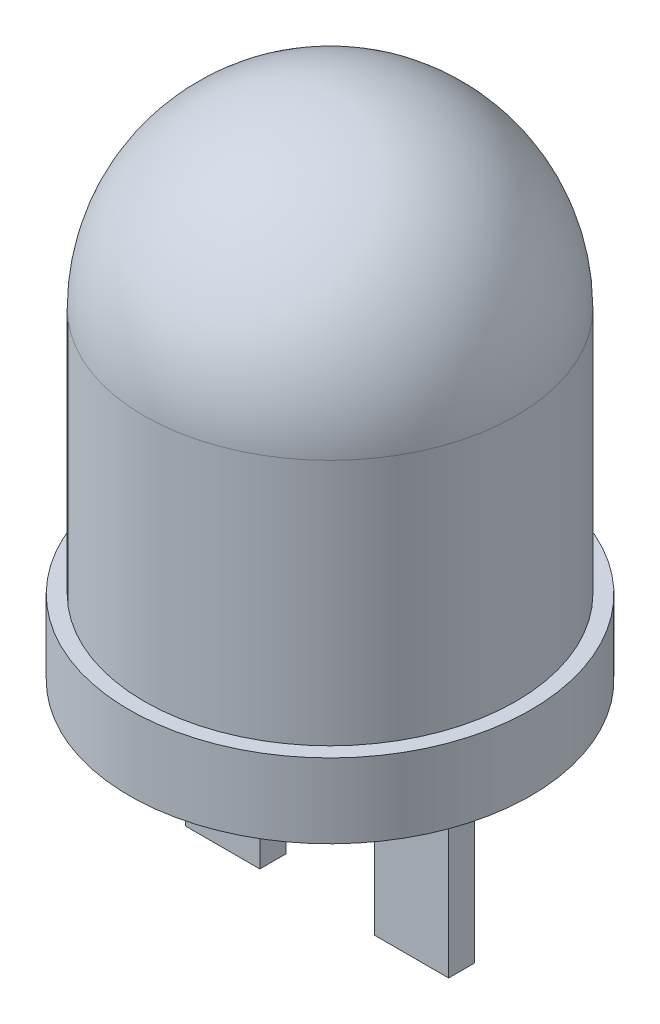
ISO-10303-21;
HEADER;
FILE_DESCRIPTION(('STEP AP214'),'2;1');
FILE_NAME('part.step','',(''),(''),'','','');
FILE_SCHEMA(('AUTOMOTIVE_DESIGN { 1 0 10303 214 1 1 1 1 }'));
ENDSEC;
DATA;
#1=APPLICATION_CONTEXT('core data for automotive mechanical design processes');
#2=APPLICATION_PROTOCOL_DEFINITION('international standard','automotive_design',2000,#1);
#3=PRODUCT_CONTEXT('',#1,'mechanical');
#4=PRODUCT('Part','Part','',(#3));
#5=PRODUCT_RELATED_PRODUCT_CATEGORY('part','',(#4));
#6=PRODUCT_DEFINITION_FORMATION('','',#4);
#7=PRODUCT_DEFINITION_CONTEXT('part definition',#1,'design');
#8=PRODUCT_DEFINITION('design','',#6,#7);
#9=PRODUCT_DEFINITION_SHAPE('','',#8);
#10=(LENGTH_UNIT() NAMED_UNIT(*) SI_UNIT(.MILLI.,.METRE.));
#11=(NAMED_UNIT(*) PLANE_ANGLE_UNIT() SI_UNIT($,.RADIAN.));
#12=(NAMED_UNIT(*) SI_UNIT($,.STERADIAN.) SOLID_ANGLE_UNIT());
#13=UNCERTAINTY_MEASURE_WITH_UNIT(LENGTH_MEASURE(1.E-05),#10,'distance_accuracy_value','');
#14=(GEOMETRIC_REPRESENTATION_CONTEXT(3) GLOBAL_UNCERTAINTY_ASSIGNED_CONTEXT((#13)) GLOBAL_UNIT_ASSIGNED_CONTEXT((#10,
#11,#12)) REPRESENTATION_CONTEXT('',''));
#15=CARTESIAN_POINT('',(0.,0.,0.));
#16=DIRECTION('',(0.,0.,1.));
#17=DIRECTION('',(1.,0.,0.));
#18=AXIS2_PLACEMENT_3D('',#15,#16,#17);
#19=CARTESIAN_POINT('',(0.,0.,0.));
#20=DIRECTION('',(0.,-1.,0.));
#21=DIRECTION('',(0.,0.,-1.));
#22=AXIS2_PLACEMENT_3D('',#19,#20,#21);
#23=PLANE('',#22);
#24=DIRECTION('',(0.,0.,1.));
#25=VECTOR('',#24,1.);
#26=CARTESIAN_POINT('',(-1.54,0.,0.));
#27=LINE('',#26,#25);
#28=CARTESIAN_POINT('',(-1.54,0.,-0.35));
#29=VERTEX_POINT('',#28);
#30=CARTESIAN_POINT('',(-1.54,0.,0.35));
#31=VERTEX_POINT('',#30);
#32=EDGE_CURVE('E11',#29,#31,#27,.T.);
#33=ORIENTED_EDGE('',*,*,#32,.F.);
#34=DIRECTION('',(1.,0.,0.));
#35=VECTOR('',#34,1.);
#36=CARTESIAN_POINT('',(0.,0.,-0.349999999999999));
#37=LINE('',#36,#35);
#38=CARTESIAN_POINT('',(-3.54,0.,-0.35));
#39=VERTEX_POINT('',#38);
#40=EDGE_CURVE('E39',#39,#29,#37,.T.);
#41=ORIENTED_EDGE('',*,*,#40,.F.);
#42=DIRECTION('',(0.,0.,-1.));
#43=VECTOR('',#42,1.);
#44=CARTESIAN_POINT('',(-3.54,0.,0.));
#45=LINE('',#44,#43);
#46=CARTESIAN_POINT('',(-3.54,0.,0.35));
#47=VERTEX_POINT('',#46);
#48=EDGE_CURVE('E169',#47,#39,#45,.T.);
#49=ORIENTED_EDGE('',*,*,#48,.F.);
#50=DIRECTION('',(-1.,0.,0.));
#51=VECTOR('',#50,1.);
#52=CARTESIAN_POINT('',(0.,0.,0.35));
#53=LINE('',#52,#51);
#54=EDGE_CURVE('E167',#31,#47,#53,.T.);
#55=ORIENTED_EDGE('',*,*,#54,.F.);
#56=EDGE_LOOP('',(#33,#41,#49,#55));
#57=FACE_BOUND('',#56,.T.);
#58=DIRECTION('',(0.,0.,-1.));
#59=VECTOR('',#58,1.);
#60=CARTESIAN_POINT('',(1.54,0.,0.));
#61=LINE('',#60,#59);
#62=CARTESIAN_POINT('',(1.54,0.,0.35));
#63=VERTEX_POINT('',#62);
#64=CARTESIAN_POINT('',(1.54,0.,-0.35));
#65=VERTEX_POINT('',#64);
#66=EDGE_CURVE('E164',#63,#65,#61,.T.);
#67=ORIENTED_EDGE('',*,*,#66,.F.);
#68=DIRECTION('',(-1.,0.,0.));
#69=VECTOR('',#68,1.);
#70=CARTESIAN_POINT('',(0.,0.,0.35));
#71=LINE('',#70,#69);
#72=CARTESIAN_POINT('',(3.54,0.,0.35));
#73=VERTEX_POINT('',#72);
#74=EDGE_CURVE('E161',#73,#63,#71,.T.);
#75=ORIENTED_EDGE('',*,*,#74,.F.);
#76=DIRECTION('',(0.,0.,1.));
#77=VECTOR('',#76,1.);
#78=CARTESIAN_POINT('',(3.54,0.,0.));
#79=LINE('',#78,#77);
#80=CARTESIAN_POINT('',(3.54,0.,-0.35));
#81=VERTEX_POINT('',#80);
#82=EDGE_CURVE('E158',#81,#73,#79,.T.);
#83=ORIENTED_EDGE('',*,*,#82,.F.);
#84=DIRECTION('',(1.,0.,0.));
#85=VECTOR('',#84,1.);
#86=CARTESIAN_POINT('',(0.,0.,-0.35));
#87=LINE('',#86,#85);
#88=EDGE_CURVE('E155',#65,#81,#87,.T.);
#89=ORIENTED_EDGE('',*,*,#88,.F.);
#90=EDGE_LOOP('',(#67,#75,#83,#89));
#91=FACE_BOUND('',#90,.T.);
#92=CARTESIAN_POINT('',(0.,0.,0.));
#93=DIRECTION('',(0.,-1.,0.));
#94=DIRECTION('',(0.,0.,-1.));
#95=AXIS2_PLACEMENT_3D('',#92,#93,#94);
#96=CIRCLE('',#95,5.4);
#97=CARTESIAN_POINT('',(0.,0.,-5.4));
#98=VERTEX_POINT('',#97);
#99=EDGE_CURVE('E152',#98,#98,#96,.T.);
#100=ORIENTED_EDGE('',*,*,#99,.T.);
#101=EDGE_LOOP('',(#100));
#102=FACE_BOUND('',#101,.T.);
#103=ADVANCED_FACE('F32',(#57,#91,#102),#23,.T.);
#104=CARTESIAN_POINT('',(0.,0.,0.));
#105=DIRECTION('',(0.,-1.,0.));
#106=DIRECTION('',(0.,0.,-1.));
#107=AXIS2_PLACEMENT_3D('',#104,#105,#106);
#108=CYLINDRICAL_SURFACE('',#107,5.4);
#109=CARTESIAN_POINT('',(0.,2.,0.));
#110=DIRECTION('',(0.,-1.,0.));
#111=DIRECTION('',(0.,0.,-1.));
#112=AXIS2_PLACEMENT_3D('',#109,#110,#111);
#113=CIRCLE('',#112,5.4);
#114=CARTESIAN_POINT('',(0.,2.,-5.4));
#115=VERTEX_POINT('',#114);
#116=EDGE_CURVE('E149',#115,#115,#113,.T.);
#117=ORIENTED_EDGE('',*,*,#116,.T.);
#118=EDGE_LOOP('',(#117));
#119=FACE_BOUND('',#118,.T.);
#120=ORIENTED_EDGE('',*,*,#99,.F.);
#121=EDGE_LOOP('',(#120));
#122=FACE_BOUND('',#121,.T.);
#123=ADVANCED_FACE('F177',(#119,#122),#108,.T.);
#124=CARTESIAN_POINT('',(5.4,2.,0.));
#125=DIRECTION('',(0.,1.,0.));
#126=DIRECTION('',(0.,0.,1.));
#127=AXIS2_PLACEMENT_3D('',#124,#125,#126);
#128=PLANE('',#127);
#129=CARTESIAN_POINT('',(0.,2.,0.));
#130=DIRECTION('',(0.,-1.,0.));
#131=DIRECTION('',(0.,0.,-1.));
#132=AXIS2_PLACEMENT_3D('',#129,#130,#131);
#133=CIRCLE('',#132,5.);
#134=CARTESIAN_POINT('',(0.,2.,-5.));
#135=VERTEX_POINT('',#134);
#136=EDGE_CURVE('E146',#135,#135,#133,.T.);
#137=ORIENTED_EDGE('',*,*,#136,.T.);
#138=EDGE_LOOP('',(#137));
#139=FACE_BOUND('',#138,.T.);
#140=ORIENTED_EDGE('',*,*,#116,.F.);
#141=EDGE_LOOP('',(#140));
#142=FACE_BOUND('',#141,.T.);
#143=ADVANCED_FACE('F182',(#139,#142),#128,.T.);
#144=CARTESIAN_POINT('',(0.,0.,0.));
#145=DIRECTION('',(0.,-1.,0.));
#146=DIRECTION('',(0.,0.,-1.));
#147=AXIS2_PLACEMENT_3D('',#144,#145,#146);
#148=CYLINDRICAL_SURFACE('',#147,5.);
#149=CARTESIAN_POINT('',(0.,8.65,0.));
#150=DIRECTION('',(0.,-1.,0.));
#151=DIRECTION('',(0.,0.,-1.));
#152=AXIS2_PLACEMENT_3D('',#149,#150,#151);
#153=CIRCLE('',#152,5.);
#154=CARTESIAN_POINT('',(0.,8.65,-5.));
#155=VERTEX_POINT('',#154);
#156=EDGE_CURVE('E138',#155,#155,#153,.T.);
#157=ORIENTED_EDGE('',*,*,#156,.T.);
#158=EDGE_LOOP('',(#157));
#159=FACE_BOUND('',#158,.T.);
#160=ORIENTED_EDGE('',*,*,#136,.F.);
#161=EDGE_LOOP('',(#160));
#162=FACE_BOUND('',#161,.T.);
#163=ADVANCED_FACE('F187',(#159,#162),#148,.T.);
#164=CARTESIAN_POINT('',(0.,8.65,0.));
#165=DIRECTION('',(0.,-1.,0.));
#166=DIRECTION('',(1.,0.,0.));
#167=AXIS2_PLACEMENT_3D('',#164,#165,#166);
#168=SPHERICAL_SURFACE('',#167,5.);
#169=ORIENTED_EDGE('',*,*,#156,.F.);
#170=EDGE_LOOP('',(#169));
#171=FACE_BOUND('',#170,.T.);
#172=ADVANCED_FACE('F193',(#171),#168,.T.);
#173=CARTESIAN_POINT('',(1.54,5.,0.35));
#174=DIRECTION('',(-1.,0.,0.));
#175=DIRECTION('',(0.,0.,1.));
#176=AXIS2_PLACEMENT_3D('',#173,#174,#175);
#177=PLANE('',#176);
#178=DIRECTION('',(0.,-1.,0.));
#179=VECTOR('',#178,1.);
#180=CARTESIAN_POINT('',(1.54,5.,0.35));
#181=LINE('',#180,#179);
#182=CARTESIAN_POINT('',(1.54,-5.,0.35));
#183=VERTEX_POINT('',#182);
#184=EDGE_CURVE('E136',#63,#183,#181,.T.);
#185=ORIENTED_EDGE('',*,*,#184,.F.);
#186=ORIENTED_EDGE('',*,*,#66,.T.);
#187=DIRECTION('',(0.,-1.,0.));
#188=VECTOR('',#187,1.);
#189=CARTESIAN_POINT('',(1.54,5.,-0.35));
#190=LINE('',#189,#188);
#191=CARTESIAN_POINT('',(1.54,-5.,-0.35));
#192=VERTEX_POINT('',#191);
#193=EDGE_CURVE('E135',#65,#192,#190,.T.);
#194=ORIENTED_EDGE('',*,*,#193,.T.);
#195=DIRECTION('',(0.,0.,-1.));
#196=VECTOR('',#195,1.);
#197=CARTESIAN_POINT('',(1.54,-5.,0.35));
#198=LINE('',#197,#196);
#199=EDGE_CURVE('E120',#183,#192,#198,.T.);
#200=ORIENTED_EDGE('',*,*,#199,.F.);
#201=EDGE_LOOP('',(#185,#186,#194,#200));
#202=FACE_BOUND('',#201,.T.);
#203=ADVANCED_FACE('F197',(#202),#177,.T.);
#204=CARTESIAN_POINT('',(1.54,5.,0.35));
#205=DIRECTION('',(0.,0.,1.));
#206=DIRECTION('',(1.,0.,0.));
#207=AXIS2_PLACEMENT_3D('',#204,#205,#206);
#208=PLANE('',#207);
#209=DIRECTION('',(0.,-1.,0.));
#210=VECTOR('',#209,1.);
#211=CARTESIAN_POINT('',(3.54,5.,0.35));
#212=LINE('',#211,#210);
#213=CARTESIAN_POINT('',(3.54,-5.,0.35));
#214=VERTEX_POINT('',#213);
#215=EDGE_CURVE('E139',#73,#214,#212,.T.);
#216=ORIENTED_EDGE('',*,*,#215,.F.);
#217=ORIENTED_EDGE('',*,*,#74,.T.);
#218=ORIENTED_EDGE('',*,*,#184,.T.);
#219=DIRECTION('',(-1.,0.,0.));
#220=VECTOR('',#219,1.);
#221=CARTESIAN_POINT('',(1.54,-5.,0.35));
#222=LINE('',#221,#220);
#223=EDGE_CURVE('E132',#214,#183,#222,.T.);
#224=ORIENTED_EDGE('',*,*,#223,.F.);
#225=EDGE_LOOP('',(#216,#217,#218,#224));
#226=FACE_BOUND('',#225,.T.);
#227=ADVANCED_FACE('F201',(#226),#208,.T.);
#228=CARTESIAN_POINT('',(3.54,5.,0.35));
#229=DIRECTION('',(1.,0.,0.));
#230=DIRECTION('',(0.,0.,-1.));
#231=AXIS2_PLACEMENT_3D('',#228,#229,#230);
#232=PLANE('',#231);
#233=DIRECTION('',(0.,-1.,0.));
#234=VECTOR('',#233,1.);
#235=CARTESIAN_POINT('',(3.54,5.,-0.35));
#236=LINE('',#235,#234);
#237=CARTESIAN_POINT('',(3.54,-5.,-0.35));
#238=VERTEX_POINT('',#237);
#239=EDGE_CURVE('E141',#81,#238,#236,.T.);
#240=ORIENTED_EDGE('',*,*,#239,.F.);
#241=ORIENTED_EDGE('',*,*,#82,.T.);
#242=ORIENTED_EDGE('',*,*,#215,.T.);
#243=DIRECTION('',(0.,0.,1.));
#244=VECTOR('',#243,1.);
#245=CARTESIAN_POINT('',(3.54,-5.,0.35));
#246=LINE('',#245,#244);
#247=EDGE_CURVE('E129',#238,#214,#246,.T.);
#248=ORIENTED_EDGE('',*,*,#247,.F.);
#249=EDGE_LOOP('',(#240,#241,#242,#248));
#250=FACE_BOUND('',#249,.T.);
#251=ADVANCED_FACE('F207',(#250),#232,.T.);
#252=CARTESIAN_POINT('',(1.54,5.,-0.35));
#253=DIRECTION('',(0.,0.,-1.));
#254=DIRECTION('',(-1.,0.,0.));
#255=AXIS2_PLACEMENT_3D('',#252,#253,#254);
#256=PLANE('',#255);
#257=ORIENTED_EDGE('',*,*,#193,.F.);
#258=ORIENTED_EDGE('',*,*,#88,.T.);
#259=ORIENTED_EDGE('',*,*,#239,.T.);
#260=DIRECTION('',(1.,0.,0.));
#261=VECTOR('',#260,1.);
#262=CARTESIAN_POINT('',(1.54,-5.,-0.35));
#263=LINE('',#262,#261);
#264=EDGE_CURVE('E126',#192,#238,#263,.T.);
#265=ORIENTED_EDGE('',*,*,#264,.F.);
#266=EDGE_LOOP('',(#257,#258,#259,#265));
#267=FACE_BOUND('',#266,.T.);
#268=ADVANCED_FACE('F203',(#267),#256,.T.);
#269=CARTESIAN_POINT('',(0.,-5.,0.));
#270=DIRECTION('',(0.,-1.,0.));
#271=DIRECTION('',(0.,0.,-1.));
#272=AXIS2_PLACEMENT_3D('',#269,#270,#271);
#273=PLANE('',#272);
#274=ORIENTED_EDGE('',*,*,#199,.T.);
#275=ORIENTED_EDGE('',*,*,#264,.T.);
#276=ORIENTED_EDGE('',*,*,#247,.T.);
#277=ORIENTED_EDGE('',*,*,#223,.T.);
#278=EDGE_LOOP('',(#274,#275,#276,#277));
#279=FACE_BOUND('',#278,.T.);
#280=ADVANCED_FACE('F206',(#279),#273,.T.);
#281=CARTESIAN_POINT('',(-1.54,5.,0.35));
#282=DIRECTION('',(1.,0.,0.));
#283=DIRECTION('',(0.,0.,-1.));
#284=AXIS2_PLACEMENT_3D('',#281,#282,#283);
#285=PLANE('',#284);
#286=DIRECTION('',(0.,-1.,0.));
#287=VECTOR('',#286,1.);
#288=CARTESIAN_POINT('',(-1.54,5.,-0.35));
#289=LINE('',#288,#287);
#290=CARTESIAN_POINT('',(-1.54,-5.,-0.35));
#291=VERTEX_POINT('',#290);
#292=EDGE_CURVE('E118',#29,#291,#289,.T.);
#293=ORIENTED_EDGE('',*,*,#292,.F.);
#294=ORIENTED_EDGE('',*,*,#32,.T.);
#295=DIRECTION('',(0.,-1.,0.));
#296=VECTOR('',#295,1.);
#297=CARTESIAN_POINT('',(-1.54,5.,0.35));
#298=LINE('',#297,#296);
#299=CARTESIAN_POINT('',(-1.54,-5.,0.35));
#300=VERTEX_POINT('',#299);
#301=EDGE_CURVE('E91',#31,#300,#298,.T.);
#302=ORIENTED_EDGE('',*,*,#301,.T.);
#303=DIRECTION('',(0.,0.,1.));
#304=VECTOR('',#303,1.);
#305=CARTESIAN_POINT('',(-1.54,-5.,0.35));
#306=LINE('',#305,#304);
#307=EDGE_CURVE('E96',#291,#300,#306,.T.);
#308=ORIENTED_EDGE('',*,*,#307,.F.);
#309=EDGE_LOOP('',(#293,#294,#302,#308));
#310=FACE_BOUND('',#309,.T.);
#311=ADVANCED_FACE('F94',(#310),#285,.T.);
#312=CARTESIAN_POINT('',(-1.54,5.,-0.35));
#313=DIRECTION('',(0.,0.,-1.));
#314=DIRECTION('',(-1.,0.,0.));
#315=AXIS2_PLACEMENT_3D('',#312,#313,#314);
#316=PLANE('',#315);
#317=DIRECTION('',(0.,-1.,0.));
#318=VECTOR('',#317,1.);
#319=CARTESIAN_POINT('',(-3.54,5.,-0.35));
#320=LINE('',#319,#318);
#321=CARTESIAN_POINT('',(-3.54,-5.,-0.35));
#322=VERTEX_POINT('',#321);
#323=EDGE_CURVE('E121',#39,#322,#320,.T.);
#324=ORIENTED_EDGE('',*,*,#323,.F.);
#325=ORIENTED_EDGE('',*,*,#40,.T.);
#326=ORIENTED_EDGE('',*,*,#292,.T.);
#327=DIRECTION('',(1.,0.,0.));
#328=VECTOR('',#327,1.);
#329=CARTESIAN_POINT('',(-1.54,-5.,-0.35));
#330=LINE('',#329,#328);
#331=EDGE_CURVE('E100',#322,#291,#330,.T.);
#332=ORIENTED_EDGE('',*,*,#331,.F.);
#333=EDGE_LOOP('',(#324,#325,#326,#332));
#334=FACE_BOUND('',#333,.T.);
#335=ADVANCED_FACE('F172',(#334),#316,.T.);
#336=CARTESIAN_POINT('',(-3.54,5.,0.35));
#337=DIRECTION('',(-1.,0.,0.));
#338=DIRECTION('',(0.,0.,1.));
#339=AXIS2_PLACEMENT_3D('',#336,#337,#338);
#340=PLANE('',#339);
#341=DIRECTION('',(0.,-1.,0.));
#342=VECTOR('',#341,1.);
#343=CARTESIAN_POINT('',(-3.54,5.,0.35));
#344=LINE('',#343,#342);
#345=CARTESIAN_POINT('',(-3.54,-5.,0.35));
#346=VERTEX_POINT('',#345);
#347=EDGE_CURVE('E99',#47,#346,#344,.T.);
#348=ORIENTED_EDGE('',*,*,#347,.F.);
#349=ORIENTED_EDGE('',*,*,#48,.T.);
#350=ORIENTED_EDGE('',*,*,#323,.T.);
#351=DIRECTION('',(0.,0.,-1.));
#352=VECTOR('',#351,1.);
#353=CARTESIAN_POINT('',(-3.54,-5.,0.35));
#354=LINE('',#353,#352);
#355=EDGE_CURVE('E109',#346,#322,#354,.T.);
#356=ORIENTED_EDGE('',*,*,#355,.F.);
#357=EDGE_LOOP('',(#348,#349,#350,#356));
#358=FACE_BOUND('',#357,.T.);
#359=ADVANCED_FACE('F174',(#358),#340,.T.);
#360=CARTESIAN_POINT('',(-1.54,5.,0.35));
#361=DIRECTION('',(0.,0.,1.));
#362=DIRECTION('',(1.,0.,0.));
#363=AXIS2_PLACEMENT_3D('',#360,#361,#362);
#364=PLANE('',#363);
#365=ORIENTED_EDGE('',*,*,#301,.F.);
#366=ORIENTED_EDGE('',*,*,#54,.T.);
#367=ORIENTED_EDGE('',*,*,#347,.T.);
#368=DIRECTION('',(-1.,0.,0.));
#369=VECTOR('',#368,1.);
#370=CARTESIAN_POINT('',(-1.54,-5.,0.35));
#371=LINE('',#370,#369);
#372=EDGE_CURVE('E103',#300,#346,#371,.T.);
#373=ORIENTED_EDGE('',*,*,#372,.F.);
#374=EDGE_LOOP('',(#365,#366,#367,#373));
#375=FACE_BOUND('',#374,.T.);
#376=ADVANCED_FACE('F104',(#375),#364,.T.);
#377=CARTESIAN_POINT('',(0.,-5.,0.));
#378=DIRECTION('',(0.,1.,0.));
#379=DIRECTION('',(0.,0.,1.));
#380=AXIS2_PLACEMENT_3D('',#377,#378,#379);
#381=PLANE('',#380);
#382=ORIENTED_EDGE('',*,*,#307,.T.);
#383=ORIENTED_EDGE('',*,*,#372,.T.);
#384=ORIENTED_EDGE('',*,*,#355,.T.);
#385=ORIENTED_EDGE('',*,*,#331,.T.);
#386=EDGE_LOOP('',(#382,#383,#384,#385));
#387=FACE_BOUND('',#386,.T.);
#388=ADVANCED_FACE('F112',(#387),#381,.F.);
#389=CLOSED_SHELL('',(#103,#123,#143,#163,#172,#203,#227,#251,#268,#280,#311,#335,#359,#376,#388));
#390=MANIFOLD_SOLID_BREP('B2',#389);
#391=ADVANCED_BREP_SHAPE_REPRESENTATION('',(#18,#390),#14);
#392=SHAPE_DEFINITION_REPRESENTATION(#9,#391);
ENDSEC;
END-ISO-10303-21;
